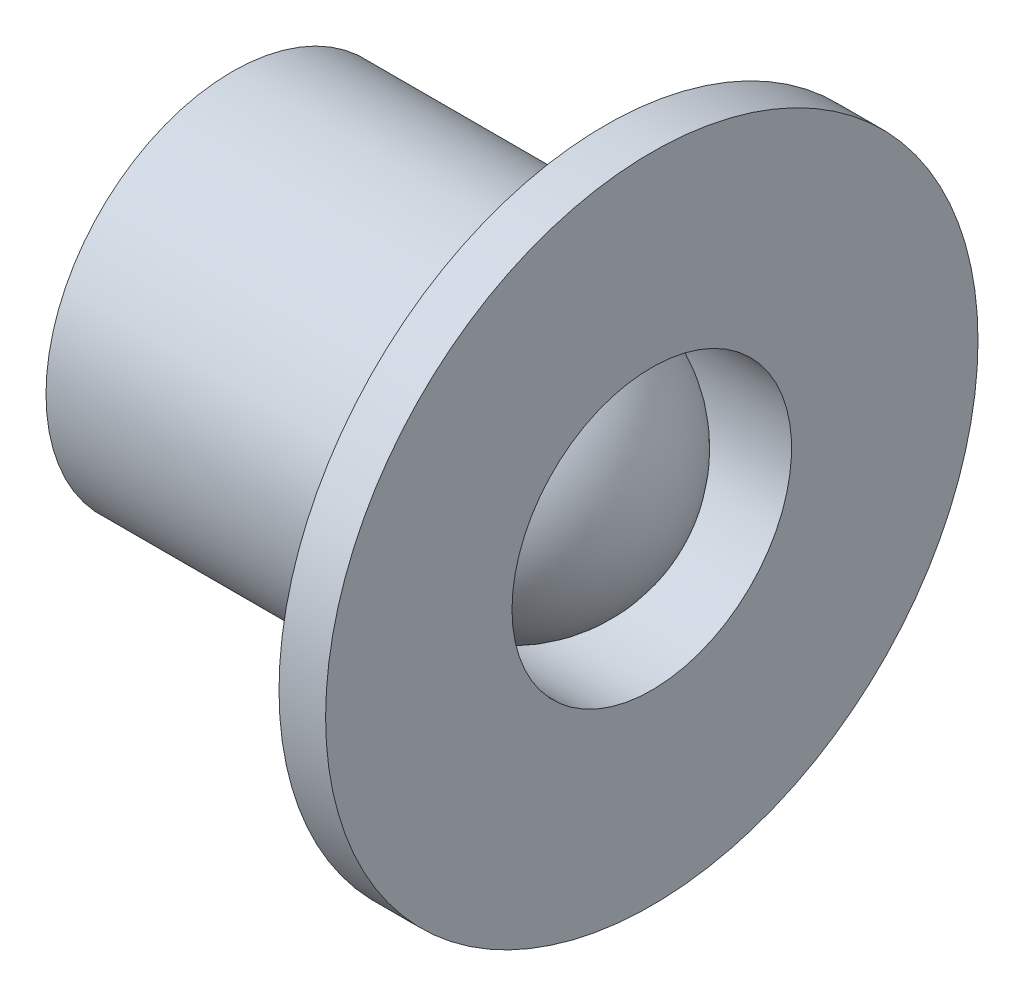
ISO-10303-21;
HEADER;
FILE_DESCRIPTION(('STEP AP214'),'2;1');
FILE_NAME('part.step','',(''),(''),'','','');
FILE_SCHEMA(('AUTOMOTIVE_DESIGN { 1 0 10303 214 1 1 1 1 }'));
ENDSEC;
DATA;
#1=APPLICATION_CONTEXT('core data for automotive mechanical design processes');
#2=APPLICATION_PROTOCOL_DEFINITION('international standard','automotive_design',2000,#1);
#3=PRODUCT_CONTEXT('',#1,'mechanical');
#4=PRODUCT('Part','Part','',(#3));
#5=PRODUCT_RELATED_PRODUCT_CATEGORY('part','',(#4));
#6=PRODUCT_DEFINITION_FORMATION('','',#4);
#7=PRODUCT_DEFINITION_CONTEXT('part definition',#1,'design');
#8=PRODUCT_DEFINITION('design','',#6,#7);
#9=PRODUCT_DEFINITION_SHAPE('','',#8);
#10=(LENGTH_UNIT() NAMED_UNIT(*) SI_UNIT(.MILLI.,.METRE.));
#11=(NAMED_UNIT(*) PLANE_ANGLE_UNIT() SI_UNIT($,.RADIAN.));
#12=(NAMED_UNIT(*) SI_UNIT($,.STERADIAN.) SOLID_ANGLE_UNIT());
#13=UNCERTAINTY_MEASURE_WITH_UNIT(LENGTH_MEASURE(1.E-05),#10,'distance_accuracy_value','');
#14=(GEOMETRIC_REPRESENTATION_CONTEXT(3) GLOBAL_UNCERTAINTY_ASSIGNED_CONTEXT((#13)) GLOBAL_UNIT_ASSIGNED_CONTEXT((#10,
#11,#12)) REPRESENTATION_CONTEXT('',''));
#15=CARTESIAN_POINT('',(0.,0.,0.));
#16=DIRECTION('',(0.,0.,1.));
#17=DIRECTION('',(1.,0.,0.));
#18=AXIS2_PLACEMENT_3D('',#15,#16,#17);
#19=CARTESIAN_POINT('',(-1.5,0.,0.));
#20=DIRECTION('',(-1.,0.,0.));
#21=DIRECTION('',(0.,1.,0.));
#22=AXIS2_PLACEMENT_3D('',#19,#20,#21);
#23=SPHERICAL_SURFACE('',#22,1.5);
#24=CARTESIAN_POINT('',(-1.5,0.,0.));
#25=DIRECTION('',(-1.,0.,0.));
#26=DIRECTION('',(0.,0.,1.));
#27=AXIS2_PLACEMENT_3D('',#24,#25,#26);
#28=CIRCLE('',#27,1.5);
#29=CARTESIAN_POINT('',(-1.5,0.,1.5));
#30=VERTEX_POINT('',#29);
#31=EDGE_CURVE('E10',#30,#30,#28,.T.);
#32=ORIENTED_EDGE('',*,*,#31,.F.);
#33=EDGE_LOOP('',(#32));
#34=FACE_BOUND('',#33,.T.);
#35=ADVANCED_FACE('F24',(#34),#23,.T.);
#36=CARTESIAN_POINT('',(0.,0.,0.));
#37=DIRECTION('',(-1.,0.,0.));
#38=DIRECTION('',(0.,0.,1.));
#39=AXIS2_PLACEMENT_3D('',#36,#37,#38);
#40=CYLINDRICAL_SURFACE('',#39,1.5);
#41=CARTESIAN_POINT('',(0.,0.,0.));
#42=DIRECTION('',(-1.,0.,0.));
#43=DIRECTION('',(0.,0.,1.));
#44=AXIS2_PLACEMENT_3D('',#41,#42,#43);
#45=CIRCLE('',#44,1.5);
#46=CARTESIAN_POINT('',(0.,0.,1.5));
#47=VERTEX_POINT('',#46);
#48=EDGE_CURVE('E30',#47,#47,#45,.T.);
#49=ORIENTED_EDGE('',*,*,#48,.F.);
#50=EDGE_LOOP('',(#49));
#51=FACE_BOUND('',#50,.T.);
#52=ORIENTED_EDGE('',*,*,#31,.T.);
#53=EDGE_LOOP('',(#52));
#54=FACE_BOUND('',#53,.T.);
#55=ADVANCED_FACE('F72',(#51,#54),#40,.F.);
#56=CARTESIAN_POINT('',(0.,1.5,0.));
#57=DIRECTION('',(-1.,0.,0.));
#58=DIRECTION('',(0.,0.,1.));
#59=AXIS2_PLACEMENT_3D('',#56,#57,#58);
#60=PLANE('',#59);
#61=CARTESIAN_POINT('',(0.,0.,0.));
#62=DIRECTION('',(-1.,0.,0.));
#63=DIRECTION('',(0.,0.,1.));
#64=AXIS2_PLACEMENT_3D('',#61,#62,#63);
#65=CIRCLE('',#64,3.5);
#66=CARTESIAN_POINT('',(0.,0.,3.5));
#67=VERTEX_POINT('',#66);
#68=EDGE_CURVE('E34',#67,#67,#65,.T.);
#69=ORIENTED_EDGE('',*,*,#68,.F.);
#70=EDGE_LOOP('',(#69));
#71=FACE_BOUND('',#70,.T.);
#72=ORIENTED_EDGE('',*,*,#48,.T.);
#73=EDGE_LOOP('',(#72));
#74=FACE_BOUND('',#73,.T.);
#75=ADVANCED_FACE('F67',(#71,#74),#60,.F.);
#76=CARTESIAN_POINT('',(0.,0.,0.));
#77=DIRECTION('',(-1.,0.,0.));
#78=DIRECTION('',(0.,0.,1.));
#79=AXIS2_PLACEMENT_3D('',#76,#77,#78);
#80=CYLINDRICAL_SURFACE('',#79,3.5);
#81=CARTESIAN_POINT('',(-0.5,0.,0.));
#82=DIRECTION('',(-1.,0.,0.));
#83=DIRECTION('',(0.,0.,1.));
#84=AXIS2_PLACEMENT_3D('',#81,#82,#83);
#85=CIRCLE('',#84,3.5);
#86=CARTESIAN_POINT('',(-0.5,0.,3.5));
#87=VERTEX_POINT('',#86);
#88=EDGE_CURVE('E38',#87,#87,#85,.T.);
#89=ORIENTED_EDGE('',*,*,#88,.F.);
#90=EDGE_LOOP('',(#89));
#91=FACE_BOUND('',#90,.T.);
#92=ORIENTED_EDGE('',*,*,#68,.T.);
#93=EDGE_LOOP('',(#92));
#94=FACE_BOUND('',#93,.T.);
#95=ADVANCED_FACE('F61',(#91,#94),#80,.T.);
#96=CARTESIAN_POINT('',(-0.5,3.5,0.));
#97=DIRECTION('',(1.,0.,0.));
#98=DIRECTION('',(0.,0.,-1.));
#99=AXIS2_PLACEMENT_3D('',#96,#97,#98);
#100=PLANE('',#99);
#101=CARTESIAN_POINT('',(-0.5,0.,0.));
#102=DIRECTION('',(-1.,0.,0.));
#103=DIRECTION('',(0.,0.,1.));
#104=AXIS2_PLACEMENT_3D('',#101,#102,#103);
#105=CIRCLE('',#104,2.);
#106=CARTESIAN_POINT('',(-0.5,0.,2.));
#107=VERTEX_POINT('',#106);
#108=EDGE_CURVE('E43',#107,#107,#105,.T.);
#109=ORIENTED_EDGE('',*,*,#108,.F.);
#110=EDGE_LOOP('',(#109));
#111=FACE_BOUND('',#110,.T.);
#112=ORIENTED_EDGE('',*,*,#88,.T.);
#113=EDGE_LOOP('',(#112));
#114=FACE_BOUND('',#113,.T.);
#115=ADVANCED_FACE('F55',(#111,#114),#100,.F.);
#116=CARTESIAN_POINT('',(0.,0.,0.));
#117=DIRECTION('',(-1.,0.,0.));
#118=DIRECTION('',(0.,0.,1.));
#119=AXIS2_PLACEMENT_3D('',#116,#117,#118);
#120=CYLINDRICAL_SURFACE('',#119,2.);
#121=CARTESIAN_POINT('',(-4.5,0.,0.));
#122=DIRECTION('',(-1.,0.,0.));
#123=DIRECTION('',(0.,0.,1.));
#124=AXIS2_PLACEMENT_3D('',#121,#122,#123);
#125=CIRCLE('',#124,2.);
#126=CARTESIAN_POINT('',(-4.5,0.,2.));
#127=VERTEX_POINT('',#126);
#128=EDGE_CURVE('E46',#127,#127,#125,.T.);
#129=ORIENTED_EDGE('',*,*,#128,.F.);
#130=EDGE_LOOP('',(#129));
#131=FACE_BOUND('',#130,.T.);
#132=ORIENTED_EDGE('',*,*,#108,.T.);
#133=EDGE_LOOP('',(#132));
#134=FACE_BOUND('',#133,.T.);
#135=ADVANCED_FACE('F52',(#131,#134),#120,.T.);
#136=CARTESIAN_POINT('',(-4.5,2.,0.));
#137=DIRECTION('',(1.,0.,0.));
#138=DIRECTION('',(0.,0.,-1.));
#139=AXIS2_PLACEMENT_3D('',#136,#137,#138);
#140=PLANE('',#139);
#141=ORIENTED_EDGE('',*,*,#128,.T.);
#142=EDGE_LOOP('',(#141));
#143=FACE_BOUND('',#142,.T.);
#144=ADVANCED_FACE('F50',(#143),#140,.F.);
#145=CLOSED_SHELL('',(#35,#55,#75,#95,#115,#135,#144));
#146=MANIFOLD_SOLID_BREP('B2',#145);
#147=ADVANCED_BREP_SHAPE_REPRESENTATION('',(#18,#146),#14);
#148=SHAPE_DEFINITION_REPRESENTATION(#9,#147);
ENDSEC;
END-ISO-10303-21;
